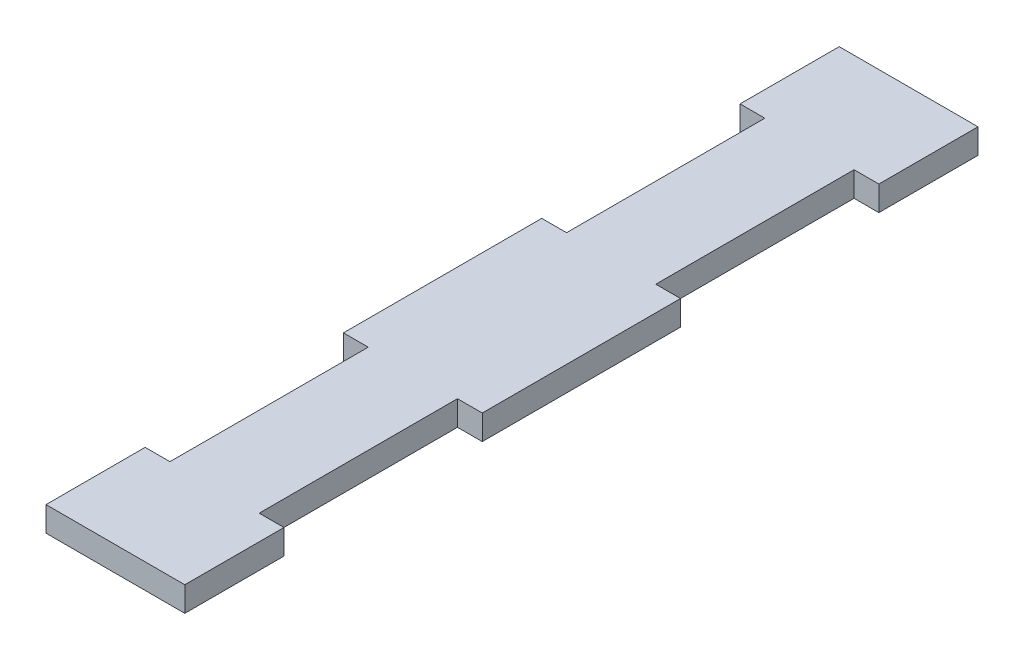
ISO-10303-21;
HEADER;
FILE_DESCRIPTION(('STEP AP214'),'2;1');
FILE_NAME('part.step','',(''),(''),'','','');
FILE_SCHEMA(('AUTOMOTIVE_DESIGN { 1 0 10303 214 1 1 1 1 }'));
ENDSEC;
DATA;
#1=APPLICATION_CONTEXT('core data for automotive mechanical design processes');
#2=APPLICATION_PROTOCOL_DEFINITION('international standard','automotive_design',2000,#1);
#3=PRODUCT_CONTEXT('',#1,'mechanical');
#4=PRODUCT('Part','Part','',(#3));
#5=PRODUCT_RELATED_PRODUCT_CATEGORY('part','',(#4));
#6=PRODUCT_DEFINITION_FORMATION('','',#4);
#7=PRODUCT_DEFINITION_CONTEXT('part definition',#1,'design');
#8=PRODUCT_DEFINITION('design','',#6,#7);
#9=PRODUCT_DEFINITION_SHAPE('','',#8);
#10=(LENGTH_UNIT() NAMED_UNIT(*) SI_UNIT(.MILLI.,.METRE.));
#11=(NAMED_UNIT(*) PLANE_ANGLE_UNIT() SI_UNIT($,.RADIAN.));
#12=(NAMED_UNIT(*) SI_UNIT($,.STERADIAN.) SOLID_ANGLE_UNIT());
#13=UNCERTAINTY_MEASURE_WITH_UNIT(LENGTH_MEASURE(1.E-05),#10,'distance_accuracy_value','');
#14=(GEOMETRIC_REPRESENTATION_CONTEXT(3) GLOBAL_UNCERTAINTY_ASSIGNED_CONTEXT((#13)) GLOBAL_UNIT_ASSIGNED_CONTEXT((#10,
#11,#12)) REPRESENTATION_CONTEXT('',''));
#15=CARTESIAN_POINT('',(0.,0.,0.));
#16=DIRECTION('',(0.,0.,1.));
#17=DIRECTION('',(1.,0.,0.));
#18=AXIS2_PLACEMENT_3D('',#15,#16,#17);
#19=CARTESIAN_POINT('',(0.,3.175,0.));
#20=DIRECTION('',(1.,0.,0.));
#21=DIRECTION('',(0.,0.,-1.));
#22=AXIS2_PLACEMENT_3D('',#19,#20,#21);
#23=PLANE('',#22);
#24=DIRECTION('',(0.,0.,1.));
#25=VECTOR('',#24,1.);
#26=CARTESIAN_POINT('',(0.,0.,0.));
#27=LINE('',#26,#25);
#28=CARTESIAN_POINT('',(0.,0.,-12.7));
#29=VERTEX_POINT('',#28);
#30=CARTESIAN_POINT('',(0.,0.,0.));
#31=VERTEX_POINT('',#30);
#32=EDGE_CURVE('E212',#29,#31,#27,.T.);
#33=ORIENTED_EDGE('',*,*,#32,.T.);
#34=DIRECTION('',(0.,-1.,0.));
#35=VECTOR('',#34,1.);
#36=CARTESIAN_POINT('',(0.,3.175,0.));
#37=LINE('',#36,#35);
#38=CARTESIAN_POINT('',(0.,3.175,0.));
#39=VERTEX_POINT('',#38);
#40=EDGE_CURVE('E11',#39,#31,#37,.T.);
#41=ORIENTED_EDGE('',*,*,#40,.F.);
#42=DIRECTION('',(0.,0.,1.));
#43=VECTOR('',#42,1.);
#44=CARTESIAN_POINT('',(0.,3.175,0.));
#45=LINE('',#44,#43);
#46=CARTESIAN_POINT('',(0.,3.175,-12.7));
#47=VERTEX_POINT('',#46);
#48=EDGE_CURVE('E270',#47,#39,#45,.T.);
#49=ORIENTED_EDGE('',*,*,#48,.F.);
#50=DIRECTION('',(0.,-1.,0.));
#51=VECTOR('',#50,1.);
#52=CARTESIAN_POINT('',(0.,3.175,-12.7));
#53=LINE('',#52,#51);
#54=EDGE_CURVE('E208',#47,#29,#53,.T.);
#55=ORIENTED_EDGE('',*,*,#54,.T.);
#56=EDGE_LOOP('',(#33,#41,#49,#55));
#57=FACE_BOUND('',#56,.T.);
#58=ADVANCED_FACE('F39',(#57),#23,.F.);
#59=CARTESIAN_POINT('',(0.,3.175,0.));
#60=DIRECTION('',(0.,0.,-1.));
#61=DIRECTION('',(-1.,0.,0.));
#62=AXIS2_PLACEMENT_3D('',#59,#60,#61);
#63=PLANE('',#62);
#64=DIRECTION('',(1.,0.,0.));
#65=VECTOR('',#64,1.);
#66=CARTESIAN_POINT('',(0.,0.,0.));
#67=LINE('',#66,#65);
#68=CARTESIAN_POINT('',(17.78,0.,0.));
#69=VERTEX_POINT('',#68);
#70=EDGE_CURVE('E216',#31,#69,#67,.T.);
#71=ORIENTED_EDGE('',*,*,#70,.T.);
#72=DIRECTION('',(0.,-1.,0.));
#73=VECTOR('',#72,1.);
#74=CARTESIAN_POINT('',(17.78,3.175,0.));
#75=LINE('',#74,#73);
#76=CARTESIAN_POINT('',(17.78,3.175,0.));
#77=VERTEX_POINT('',#76);
#78=EDGE_CURVE('E48',#77,#69,#75,.T.);
#79=ORIENTED_EDGE('',*,*,#78,.F.);
#80=DIRECTION('',(1.,0.,0.));
#81=VECTOR('',#80,1.);
#82=CARTESIAN_POINT('',(0.,3.175,0.));
#83=LINE('',#82,#81);
#84=EDGE_CURVE('E135',#39,#77,#83,.T.);
#85=ORIENTED_EDGE('',*,*,#84,.F.);
#86=ORIENTED_EDGE('',*,*,#40,.T.);
#87=EDGE_LOOP('',(#71,#79,#85,#86));
#88=FACE_BOUND('',#87,.T.);
#89=ADVANCED_FACE('F420',(#88),#63,.F.);
#90=CARTESIAN_POINT('',(17.78,3.175,0.));
#91=DIRECTION('',(-1.,0.,0.));
#92=DIRECTION('',(0.,0.,1.));
#93=AXIS2_PLACEMENT_3D('',#90,#91,#92);
#94=PLANE('',#93);
#95=DIRECTION('',(0.,0.,-1.));
#96=VECTOR('',#95,1.);
#97=CARTESIAN_POINT('',(17.78,0.,0.));
#98=LINE('',#97,#96);
#99=CARTESIAN_POINT('',(17.78,0.,-12.7));
#100=VERTEX_POINT('',#99);
#101=EDGE_CURVE('E219',#69,#100,#98,.T.);
#102=ORIENTED_EDGE('',*,*,#101,.T.);
#103=DIRECTION('',(0.,-1.,0.));
#104=VECTOR('',#103,1.);
#105=CARTESIAN_POINT('',(17.78,3.175,-12.7));
#106=LINE('',#105,#104);
#107=CARTESIAN_POINT('',(17.78,3.175,-12.7));
#108=VERTEX_POINT('',#107);
#109=EDGE_CURVE('E329',#108,#100,#106,.T.);
#110=ORIENTED_EDGE('',*,*,#109,.F.);
#111=DIRECTION('',(0.,0.,-1.));
#112=VECTOR('',#111,1.);
#113=CARTESIAN_POINT('',(17.78,3.175,0.));
#114=LINE('',#113,#112);
#115=EDGE_CURVE('E339',#77,#108,#114,.T.);
#116=ORIENTED_EDGE('',*,*,#115,.F.);
#117=ORIENTED_EDGE('',*,*,#78,.T.);
#118=EDGE_LOOP('',(#102,#110,#116,#117));
#119=FACE_BOUND('',#118,.T.);
#120=ADVANCED_FACE('F337',(#119),#94,.F.);
#121=CARTESIAN_POINT('',(17.78,3.175,-12.7));
#122=DIRECTION('',(0.,0.,1.));
#123=DIRECTION('',(1.,0.,0.));
#124=AXIS2_PLACEMENT_3D('',#121,#122,#123);
#125=PLANE('',#124);
#126=DIRECTION('',(-1.,0.,0.));
#127=VECTOR('',#126,1.);
#128=CARTESIAN_POINT('',(17.78,0.,-12.7));
#129=LINE('',#128,#127);
#130=CARTESIAN_POINT('',(14.605,0.,-12.7));
#131=VERTEX_POINT('',#130);
#132=EDGE_CURVE('E222',#100,#131,#129,.T.);
#133=ORIENTED_EDGE('',*,*,#132,.T.);
#134=DIRECTION('',(0.,-1.,0.));
#135=VECTOR('',#134,1.);
#136=CARTESIAN_POINT('',(14.605,3.175,-12.7));
#137=LINE('',#136,#135);
#138=CARTESIAN_POINT('',(14.605,3.175,-12.7));
#139=VERTEX_POINT('',#138);
#140=EDGE_CURVE('E325',#139,#131,#137,.T.);
#141=ORIENTED_EDGE('',*,*,#140,.F.);
#142=DIRECTION('',(-1.,0.,0.));
#143=VECTOR('',#142,1.);
#144=CARTESIAN_POINT('',(17.78,3.175,-12.7));
#145=LINE('',#144,#143);
#146=EDGE_CURVE('E358',#108,#139,#145,.T.);
#147=ORIENTED_EDGE('',*,*,#146,.F.);
#148=ORIENTED_EDGE('',*,*,#109,.T.);
#149=EDGE_LOOP('',(#133,#141,#147,#148));
#150=FACE_BOUND('',#149,.T.);
#151=ADVANCED_FACE('F348',(#150),#125,.F.);
#152=CARTESIAN_POINT('',(14.605,3.175,-38.1));
#153=DIRECTION('',(-1.,0.,0.));
#154=DIRECTION('',(0.,0.,1.));
#155=AXIS2_PLACEMENT_3D('',#152,#153,#154);
#156=PLANE('',#155);
#157=DIRECTION('',(0.,0.,-1.));
#158=VECTOR('',#157,1.);
#159=CARTESIAN_POINT('',(14.605,0.,-38.1));
#160=LINE('',#159,#158);
#161=CARTESIAN_POINT('',(14.605,0.,-38.1));
#162=VERTEX_POINT('',#161);
#163=EDGE_CURVE('E225',#131,#162,#160,.T.);
#164=ORIENTED_EDGE('',*,*,#163,.T.);
#165=DIRECTION('',(0.,-1.,0.));
#166=VECTOR('',#165,1.);
#167=CARTESIAN_POINT('',(14.605,3.175,-38.1));
#168=LINE('',#167,#166);
#169=CARTESIAN_POINT('',(14.605,3.175,-38.1));
#170=VERTEX_POINT('',#169);
#171=EDGE_CURVE('E321',#170,#162,#168,.T.);
#172=ORIENTED_EDGE('',*,*,#171,.F.);
#173=DIRECTION('',(0.,0.,-1.));
#174=VECTOR('',#173,1.);
#175=CARTESIAN_POINT('',(14.605,3.175,-38.1));
#176=LINE('',#175,#174);
#177=EDGE_CURVE('E354',#139,#170,#176,.T.);
#178=ORIENTED_EDGE('',*,*,#177,.F.);
#179=ORIENTED_EDGE('',*,*,#140,.T.);
#180=EDGE_LOOP('',(#164,#172,#178,#179));
#181=FACE_BOUND('',#180,.T.);
#182=ADVANCED_FACE('F352',(#181),#156,.F.);
#183=CARTESIAN_POINT('',(17.78,3.175,-38.1));
#184=DIRECTION('',(0.,0.,-1.));
#185=DIRECTION('',(-1.,0.,0.));
#186=AXIS2_PLACEMENT_3D('',#183,#184,#185);
#187=PLANE('',#186);
#188=DIRECTION('',(1.,0.,0.));
#189=VECTOR('',#188,1.);
#190=CARTESIAN_POINT('',(17.78,0.,-38.1));
#191=LINE('',#190,#189);
#192=CARTESIAN_POINT('',(17.78,0.,-38.1));
#193=VERTEX_POINT('',#192);
#194=EDGE_CURVE('E228',#162,#193,#191,.T.);
#195=ORIENTED_EDGE('',*,*,#194,.T.);
#196=DIRECTION('',(0.,-1.,0.));
#197=VECTOR('',#196,1.);
#198=CARTESIAN_POINT('',(17.78,3.175,-38.1));
#199=LINE('',#198,#197);
#200=CARTESIAN_POINT('',(17.78,3.175,-38.1));
#201=VERTEX_POINT('',#200);
#202=EDGE_CURVE('E317',#201,#193,#199,.T.);
#203=ORIENTED_EDGE('',*,*,#202,.F.);
#204=DIRECTION('',(1.,0.,0.));
#205=VECTOR('',#204,1.);
#206=CARTESIAN_POINT('',(17.78,3.175,-38.1));
#207=LINE('',#206,#205);
#208=EDGE_CURVE('E357',#170,#201,#207,.T.);
#209=ORIENTED_EDGE('',*,*,#208,.F.);
#210=ORIENTED_EDGE('',*,*,#171,.T.);
#211=EDGE_LOOP('',(#195,#203,#209,#210));
#212=FACE_BOUND('',#211,.T.);
#213=ADVANCED_FACE('F433',(#212),#187,.F.);
#214=CARTESIAN_POINT('',(17.78,3.175,-38.1));
#215=DIRECTION('',(-1.,0.,0.));
#216=DIRECTION('',(0.,0.,1.));
#217=AXIS2_PLACEMENT_3D('',#214,#215,#216);
#218=PLANE('',#217);
#219=DIRECTION('',(0.,0.,-1.));
#220=VECTOR('',#219,1.);
#221=CARTESIAN_POINT('',(17.78,0.,-38.1));
#222=LINE('',#221,#220);
#223=CARTESIAN_POINT('',(17.78,0.,-63.5));
#224=VERTEX_POINT('',#223);
#225=EDGE_CURVE('E231',#193,#224,#222,.T.);
#226=ORIENTED_EDGE('',*,*,#225,.T.);
#227=DIRECTION('',(0.,-1.,0.));
#228=VECTOR('',#227,1.);
#229=CARTESIAN_POINT('',(17.78,3.175,-63.5));
#230=LINE('',#229,#228);
#231=CARTESIAN_POINT('',(17.78,3.175,-63.5));
#232=VERTEX_POINT('',#231);
#233=EDGE_CURVE('E313',#232,#224,#230,.T.);
#234=ORIENTED_EDGE('',*,*,#233,.F.);
#235=DIRECTION('',(0.,0.,-1.));
#236=VECTOR('',#235,1.);
#237=CARTESIAN_POINT('',(17.78,3.175,-38.1));
#238=LINE('',#237,#236);
#239=EDGE_CURVE('E362',#201,#232,#238,.T.);
#240=ORIENTED_EDGE('',*,*,#239,.F.);
#241=ORIENTED_EDGE('',*,*,#202,.T.);
#242=EDGE_LOOP('',(#226,#234,#240,#241));
#243=FACE_BOUND('',#242,.T.);
#244=ADVANCED_FACE('F436',(#243),#218,.F.);
#245=CARTESIAN_POINT('',(17.78,3.175,-63.5));
#246=DIRECTION('',(0.,0.,1.));
#247=DIRECTION('',(1.,0.,0.));
#248=AXIS2_PLACEMENT_3D('',#245,#246,#247);
#249=PLANE('',#248);
#250=DIRECTION('',(-1.,0.,0.));
#251=VECTOR('',#250,1.);
#252=CARTESIAN_POINT('',(17.78,0.,-63.5));
#253=LINE('',#252,#251);
#254=CARTESIAN_POINT('',(14.605,0.,-63.5));
#255=VERTEX_POINT('',#254);
#256=EDGE_CURVE('E234',#224,#255,#253,.T.);
#257=ORIENTED_EDGE('',*,*,#256,.T.);
#258=DIRECTION('',(0.,-1.,0.));
#259=VECTOR('',#258,1.);
#260=CARTESIAN_POINT('',(14.605,3.175,-63.5));
#261=LINE('',#260,#259);
#262=CARTESIAN_POINT('',(14.605,3.175,-63.5));
#263=VERTEX_POINT('',#262);
#264=EDGE_CURVE('E309',#263,#255,#261,.T.);
#265=ORIENTED_EDGE('',*,*,#264,.F.);
#266=DIRECTION('',(-1.,0.,0.));
#267=VECTOR('',#266,1.);
#268=CARTESIAN_POINT('',(17.78,3.175,-63.5));
#269=LINE('',#268,#267);
#270=EDGE_CURVE('E369',#232,#263,#269,.T.);
#271=ORIENTED_EDGE('',*,*,#270,.F.);
#272=ORIENTED_EDGE('',*,*,#233,.T.);
#273=EDGE_LOOP('',(#257,#265,#271,#272));
#274=FACE_BOUND('',#273,.T.);
#275=ADVANCED_FACE('F440',(#274),#249,.F.);
#276=CARTESIAN_POINT('',(14.605,3.175,-88.9));
#277=DIRECTION('',(-1.,0.,0.));
#278=DIRECTION('',(0.,0.,1.));
#279=AXIS2_PLACEMENT_3D('',#276,#277,#278);
#280=PLANE('',#279);
#281=DIRECTION('',(0.,0.,-1.));
#282=VECTOR('',#281,1.);
#283=CARTESIAN_POINT('',(14.605,0.,-88.9));
#284=LINE('',#283,#282);
#285=CARTESIAN_POINT('',(14.605,0.,-88.9));
#286=VERTEX_POINT('',#285);
#287=EDGE_CURVE('E237',#255,#286,#284,.T.);
#288=ORIENTED_EDGE('',*,*,#287,.T.);
#289=DIRECTION('',(0.,-1.,0.));
#290=VECTOR('',#289,1.);
#291=CARTESIAN_POINT('',(14.605,3.175,-88.9));
#292=LINE('',#291,#290);
#293=CARTESIAN_POINT('',(14.605,3.175,-88.9));
#294=VERTEX_POINT('',#293);
#295=EDGE_CURVE('E305',#294,#286,#292,.T.);
#296=ORIENTED_EDGE('',*,*,#295,.F.);
#297=DIRECTION('',(0.,0.,-1.));
#298=VECTOR('',#297,1.);
#299=CARTESIAN_POINT('',(14.605,3.175,-88.9));
#300=LINE('',#299,#298);
#301=EDGE_CURVE('E372',#263,#294,#300,.T.);
#302=ORIENTED_EDGE('',*,*,#301,.F.);
#303=ORIENTED_EDGE('',*,*,#264,.T.);
#304=EDGE_LOOP('',(#288,#296,#302,#303));
#305=FACE_BOUND('',#304,.T.);
#306=ADVANCED_FACE('F444',(#305),#280,.F.);
#307=CARTESIAN_POINT('',(17.78,3.175,-88.9));
#308=DIRECTION('',(0.,0.,-1.));
#309=DIRECTION('',(-1.,0.,0.));
#310=AXIS2_PLACEMENT_3D('',#307,#308,#309);
#311=PLANE('',#310);
#312=DIRECTION('',(1.,0.,0.));
#313=VECTOR('',#312,1.);
#314=CARTESIAN_POINT('',(17.78,0.,-88.9));
#315=LINE('',#314,#313);
#316=CARTESIAN_POINT('',(17.78,0.,-88.9));
#317=VERTEX_POINT('',#316);
#318=EDGE_CURVE('E240',#286,#317,#315,.T.);
#319=ORIENTED_EDGE('',*,*,#318,.T.);
#320=DIRECTION('',(0.,-1.,0.));
#321=VECTOR('',#320,1.);
#322=CARTESIAN_POINT('',(17.78,3.175,-88.9));
#323=LINE('',#322,#321);
#324=CARTESIAN_POINT('',(17.78,3.175,-88.9));
#325=VERTEX_POINT('',#324);
#326=EDGE_CURVE('E301',#325,#317,#323,.T.);
#327=ORIENTED_EDGE('',*,*,#326,.F.);
#328=DIRECTION('',(1.,0.,0.));
#329=VECTOR('',#328,1.);
#330=CARTESIAN_POINT('',(17.78,3.175,-88.9));
#331=LINE('',#330,#329);
#332=EDGE_CURVE('E375',#294,#325,#331,.T.);
#333=ORIENTED_EDGE('',*,*,#332,.F.);
#334=ORIENTED_EDGE('',*,*,#295,.T.);
#335=EDGE_LOOP('',(#319,#327,#333,#334));
#336=FACE_BOUND('',#335,.T.);
#337=ADVANCED_FACE('F448',(#336),#311,.F.);
#338=CARTESIAN_POINT('',(17.78,3.175,-88.9));
#339=DIRECTION('',(-1.,0.,0.));
#340=DIRECTION('',(0.,0.,1.));
#341=AXIS2_PLACEMENT_3D('',#338,#339,#340);
#342=PLANE('',#341);
#343=DIRECTION('',(0.,0.,-1.));
#344=VECTOR('',#343,1.);
#345=CARTESIAN_POINT('',(17.78,0.,-88.9));
#346=LINE('',#345,#344);
#347=CARTESIAN_POINT('',(17.78,0.,-101.6));
#348=VERTEX_POINT('',#347);
#349=EDGE_CURVE('E243',#317,#348,#346,.T.);
#350=ORIENTED_EDGE('',*,*,#349,.T.);
#351=DIRECTION('',(0.,-1.,0.));
#352=VECTOR('',#351,1.);
#353=CARTESIAN_POINT('',(17.78,3.175,-101.6));
#354=LINE('',#353,#352);
#355=CARTESIAN_POINT('',(17.78,3.175,-101.6));
#356=VERTEX_POINT('',#355);
#357=EDGE_CURVE('E297',#356,#348,#354,.T.);
#358=ORIENTED_EDGE('',*,*,#357,.F.);
#359=DIRECTION('',(0.,0.,-1.));
#360=VECTOR('',#359,1.);
#361=CARTESIAN_POINT('',(17.78,3.175,-88.9));
#362=LINE('',#361,#360);
#363=EDGE_CURVE('E378',#325,#356,#362,.T.);
#364=ORIENTED_EDGE('',*,*,#363,.F.);
#365=ORIENTED_EDGE('',*,*,#326,.T.);
#366=EDGE_LOOP('',(#350,#358,#364,#365));
#367=FACE_BOUND('',#366,.T.);
#368=ADVANCED_FACE('F452',(#367),#342,.F.);
#369=CARTESIAN_POINT('',(0.,3.175,-101.6));
#370=DIRECTION('',(0.,0.,1.));
#371=DIRECTION('',(1.,0.,0.));
#372=AXIS2_PLACEMENT_3D('',#369,#370,#371);
#373=PLANE('',#372);
#374=DIRECTION('',(-1.,0.,0.));
#375=VECTOR('',#374,1.);
#376=CARTESIAN_POINT('',(0.,0.,-101.6));
#377=LINE('',#376,#375);
#378=CARTESIAN_POINT('',(0.,0.,-101.6));
#379=VERTEX_POINT('',#378);
#380=EDGE_CURVE('E246',#348,#379,#377,.T.);
#381=ORIENTED_EDGE('',*,*,#380,.T.);
#382=DIRECTION('',(0.,-1.,0.));
#383=VECTOR('',#382,1.);
#384=CARTESIAN_POINT('',(0.,3.175,-101.6));
#385=LINE('',#384,#383);
#386=CARTESIAN_POINT('',(0.,3.175,-101.6));
#387=VERTEX_POINT('',#386);
#388=EDGE_CURVE('E293',#387,#379,#385,.T.);
#389=ORIENTED_EDGE('',*,*,#388,.F.);
#390=DIRECTION('',(-1.,0.,0.));
#391=VECTOR('',#390,1.);
#392=CARTESIAN_POINT('',(0.,3.175,-101.6));
#393=LINE('',#392,#391);
#394=EDGE_CURVE('E381',#356,#387,#393,.T.);
#395=ORIENTED_EDGE('',*,*,#394,.F.);
#396=ORIENTED_EDGE('',*,*,#357,.T.);
#397=EDGE_LOOP('',(#381,#389,#395,#396));
#398=FACE_BOUND('',#397,.T.);
#399=ADVANCED_FACE('F456',(#398),#373,.F.);
#400=CARTESIAN_POINT('',(0.,3.175,-88.9));
#401=DIRECTION('',(1.,0.,0.));
#402=DIRECTION('',(0.,0.,-1.));
#403=AXIS2_PLACEMENT_3D('',#400,#401,#402);
#404=PLANE('',#403);
#405=DIRECTION('',(0.,0.,1.));
#406=VECTOR('',#405,1.);
#407=CARTESIAN_POINT('',(0.,0.,-88.9));
#408=LINE('',#407,#406);
#409=CARTESIAN_POINT('',(0.,0.,-88.9));
#410=VERTEX_POINT('',#409);
#411=EDGE_CURVE('E249',#379,#410,#408,.T.);
#412=ORIENTED_EDGE('',*,*,#411,.T.);
#413=DIRECTION('',(0.,-1.,0.));
#414=VECTOR('',#413,1.);
#415=CARTESIAN_POINT('',(0.,3.175,-88.9));
#416=LINE('',#415,#414);
#417=CARTESIAN_POINT('',(0.,3.175,-88.9));
#418=VERTEX_POINT('',#417);
#419=EDGE_CURVE('E289',#418,#410,#416,.T.);
#420=ORIENTED_EDGE('',*,*,#419,.F.);
#421=DIRECTION('',(0.,0.,1.));
#422=VECTOR('',#421,1.);
#423=CARTESIAN_POINT('',(0.,3.175,-88.9));
#424=LINE('',#423,#422);
#425=EDGE_CURVE('E384',#387,#418,#424,.T.);
#426=ORIENTED_EDGE('',*,*,#425,.F.);
#427=ORIENTED_EDGE('',*,*,#388,.T.);
#428=EDGE_LOOP('',(#412,#420,#426,#427));
#429=FACE_BOUND('',#428,.T.);
#430=ADVANCED_FACE('F460',(#429),#404,.F.);
#431=CARTESIAN_POINT('',(0.,3.175,-88.9));
#432=DIRECTION('',(0.,0.,-1.));
#433=DIRECTION('',(-1.,0.,0.));
#434=AXIS2_PLACEMENT_3D('',#431,#432,#433);
#435=PLANE('',#434);
#436=DIRECTION('',(1.,0.,0.));
#437=VECTOR('',#436,1.);
#438=CARTESIAN_POINT('',(0.,0.,-88.9));
#439=LINE('',#438,#437);
#440=CARTESIAN_POINT('',(3.175,0.,-88.9));
#441=VERTEX_POINT('',#440);
#442=EDGE_CURVE('E252',#410,#441,#439,.T.);
#443=ORIENTED_EDGE('',*,*,#442,.T.);
#444=DIRECTION('',(0.,-1.,0.));
#445=VECTOR('',#444,1.);
#446=CARTESIAN_POINT('',(3.175,3.175,-88.9));
#447=LINE('',#446,#445);
#448=CARTESIAN_POINT('',(3.175,3.175,-88.9));
#449=VERTEX_POINT('',#448);
#450=EDGE_CURVE('E285',#449,#441,#447,.T.);
#451=ORIENTED_EDGE('',*,*,#450,.F.);
#452=DIRECTION('',(1.,0.,0.));
#453=VECTOR('',#452,1.);
#454=CARTESIAN_POINT('',(0.,3.175,-88.9));
#455=LINE('',#454,#453);
#456=EDGE_CURVE('E387',#418,#449,#455,.T.);
#457=ORIENTED_EDGE('',*,*,#456,.F.);
#458=ORIENTED_EDGE('',*,*,#419,.T.);
#459=EDGE_LOOP('',(#443,#451,#457,#458));
#460=FACE_BOUND('',#459,.T.);
#461=ADVANCED_FACE('F464',(#460),#435,.F.);
#462=CARTESIAN_POINT('',(3.175,3.175,-88.9));
#463=DIRECTION('',(1.,0.,0.));
#464=DIRECTION('',(0.,0.,-1.));
#465=AXIS2_PLACEMENT_3D('',#462,#463,#464);
#466=PLANE('',#465);
#467=DIRECTION('',(0.,0.,1.));
#468=VECTOR('',#467,1.);
#469=CARTESIAN_POINT('',(3.175,0.,-88.9));
#470=LINE('',#469,#468);
#471=CARTESIAN_POINT('',(3.175,0.,-63.5));
#472=VERTEX_POINT('',#471);
#473=EDGE_CURVE('E255',#441,#472,#470,.T.);
#474=ORIENTED_EDGE('',*,*,#473,.T.);
#475=DIRECTION('',(0.,-1.,0.));
#476=VECTOR('',#475,1.);
#477=CARTESIAN_POINT('',(3.175,3.175,-63.5));
#478=LINE('',#477,#476);
#479=CARTESIAN_POINT('',(3.175,3.175,-63.5));
#480=VERTEX_POINT('',#479);
#481=EDGE_CURVE('E281',#480,#472,#478,.T.);
#482=ORIENTED_EDGE('',*,*,#481,.F.);
#483=DIRECTION('',(0.,0.,1.));
#484=VECTOR('',#483,1.);
#485=CARTESIAN_POINT('',(3.175,3.175,-88.9));
#486=LINE('',#485,#484);
#487=EDGE_CURVE('E390',#449,#480,#486,.T.);
#488=ORIENTED_EDGE('',*,*,#487,.F.);
#489=ORIENTED_EDGE('',*,*,#450,.T.);
#490=EDGE_LOOP('',(#474,#482,#488,#489));
#491=FACE_BOUND('',#490,.T.);
#492=ADVANCED_FACE('F468',(#491),#466,.F.);
#493=CARTESIAN_POINT('',(0.,3.175,-63.5));
#494=DIRECTION('',(0.,0.,1.));
#495=DIRECTION('',(1.,0.,0.));
#496=AXIS2_PLACEMENT_3D('',#493,#494,#495);
#497=PLANE('',#496);
#498=DIRECTION('',(-1.,0.,0.));
#499=VECTOR('',#498,1.);
#500=CARTESIAN_POINT('',(0.,0.,-63.5));
#501=LINE('',#500,#499);
#502=CARTESIAN_POINT('',(0.,0.,-63.5));
#503=VERTEX_POINT('',#502);
#504=EDGE_CURVE('E258',#472,#503,#501,.T.);
#505=ORIENTED_EDGE('',*,*,#504,.T.);
#506=DIRECTION('',(0.,-1.,0.));
#507=VECTOR('',#506,1.);
#508=CARTESIAN_POINT('',(0.,3.175,-63.5));
#509=LINE('',#508,#507);
#510=CARTESIAN_POINT('',(0.,3.175,-63.5));
#511=VERTEX_POINT('',#510);
#512=EDGE_CURVE('E277',#511,#503,#509,.T.);
#513=ORIENTED_EDGE('',*,*,#512,.F.);
#514=DIRECTION('',(-1.,0.,0.));
#515=VECTOR('',#514,1.);
#516=CARTESIAN_POINT('',(0.,3.175,-63.5));
#517=LINE('',#516,#515);
#518=EDGE_CURVE('E393',#480,#511,#517,.T.);
#519=ORIENTED_EDGE('',*,*,#518,.F.);
#520=ORIENTED_EDGE('',*,*,#481,.T.);
#521=EDGE_LOOP('',(#505,#513,#519,#520));
#522=FACE_BOUND('',#521,.T.);
#523=ADVANCED_FACE('F401',(#522),#497,.F.);
#524=CARTESIAN_POINT('',(0.,3.175,-38.1));
#525=DIRECTION('',(1.,0.,0.));
#526=DIRECTION('',(0.,0.,-1.));
#527=AXIS2_PLACEMENT_3D('',#524,#525,#526);
#528=PLANE('',#527);
#529=DIRECTION('',(0.,0.,1.));
#530=VECTOR('',#529,1.);
#531=CARTESIAN_POINT('',(0.,0.,-38.1));
#532=LINE('',#531,#530);
#533=CARTESIAN_POINT('',(0.,0.,-38.1));
#534=VERTEX_POINT('',#533);
#535=EDGE_CURVE('E261',#503,#534,#532,.T.);
#536=ORIENTED_EDGE('',*,*,#535,.T.);
#537=DIRECTION('',(0.,-1.,0.));
#538=VECTOR('',#537,1.);
#539=CARTESIAN_POINT('',(0.,3.175,-38.1));
#540=LINE('',#539,#538);
#541=CARTESIAN_POINT('',(0.,3.175,-38.1));
#542=VERTEX_POINT('',#541);
#543=EDGE_CURVE('E201',#542,#534,#540,.T.);
#544=ORIENTED_EDGE('',*,*,#543,.F.);
#545=DIRECTION('',(0.,0.,1.));
#546=VECTOR('',#545,1.);
#547=CARTESIAN_POINT('',(0.,3.175,-38.1));
#548=LINE('',#547,#546);
#549=EDGE_CURVE('E190',#511,#542,#548,.T.);
#550=ORIENTED_EDGE('',*,*,#549,.F.);
#551=ORIENTED_EDGE('',*,*,#512,.T.);
#552=EDGE_LOOP('',(#536,#544,#550,#551));
#553=FACE_BOUND('',#552,.T.);
#554=ADVANCED_FACE('F405',(#553),#528,.F.);
#555=CARTESIAN_POINT('',(0.,3.175,-38.1));
#556=DIRECTION('',(0.,0.,-1.));
#557=DIRECTION('',(-1.,0.,0.));
#558=AXIS2_PLACEMENT_3D('',#555,#556,#557);
#559=PLANE('',#558);
#560=DIRECTION('',(1.,0.,0.));
#561=VECTOR('',#560,1.);
#562=CARTESIAN_POINT('',(0.,0.,-38.1));
#563=LINE('',#562,#561);
#564=CARTESIAN_POINT('',(3.175,0.,-38.1));
#565=VERTEX_POINT('',#564);
#566=EDGE_CURVE('E199',#534,#565,#563,.T.);
#567=ORIENTED_EDGE('',*,*,#566,.T.);
#568=DIRECTION('',(0.,-1.,0.));
#569=VECTOR('',#568,1.);
#570=CARTESIAN_POINT('',(3.175,3.175,-38.1));
#571=LINE('',#570,#569);
#572=CARTESIAN_POINT('',(3.175,3.175,-38.1));
#573=VERTEX_POINT('',#572);
#574=EDGE_CURVE('E196',#573,#565,#571,.T.);
#575=ORIENTED_EDGE('',*,*,#574,.F.);
#576=DIRECTION('',(1.,0.,0.));
#577=VECTOR('',#576,1.);
#578=CARTESIAN_POINT('',(0.,3.175,-38.1));
#579=LINE('',#578,#577);
#580=EDGE_CURVE('E184',#542,#573,#579,.T.);
#581=ORIENTED_EDGE('',*,*,#580,.F.);
#582=ORIENTED_EDGE('',*,*,#543,.T.);
#583=EDGE_LOOP('',(#567,#575,#581,#582));
#584=FACE_BOUND('',#583,.T.);
#585=ADVANCED_FACE('F197',(#584),#559,.F.);
#586=CARTESIAN_POINT('',(3.175,3.175,-38.1));
#587=DIRECTION('',(1.,0.,0.));
#588=DIRECTION('',(0.,0.,-1.));
#589=AXIS2_PLACEMENT_3D('',#586,#587,#588);
#590=PLANE('',#589);
#591=DIRECTION('',(0.,0.,1.));
#592=VECTOR('',#591,1.);
#593=CARTESIAN_POINT('',(3.175,0.,-38.1));
#594=LINE('',#593,#592);
#595=CARTESIAN_POINT('',(3.175,0.,-12.7));
#596=VERTEX_POINT('',#595);
#597=EDGE_CURVE('E121',#565,#596,#594,.T.);
#598=ORIENTED_EDGE('',*,*,#597,.T.);
#599=DIRECTION('',(0.,-1.,0.));
#600=VECTOR('',#599,1.);
#601=CARTESIAN_POINT('',(3.175,3.175,-12.7));
#602=LINE('',#601,#600);
#603=CARTESIAN_POINT('',(3.175,3.175,-12.7));
#604=VERTEX_POINT('',#603);
#605=EDGE_CURVE('E202',#604,#596,#602,.T.);
#606=ORIENTED_EDGE('',*,*,#605,.F.);
#607=DIRECTION('',(0.,0.,1.));
#608=VECTOR('',#607,1.);
#609=CARTESIAN_POINT('',(3.175,3.175,-38.1));
#610=LINE('',#609,#608);
#611=EDGE_CURVE('E188',#573,#604,#610,.T.);
#612=ORIENTED_EDGE('',*,*,#611,.F.);
#613=ORIENTED_EDGE('',*,*,#574,.T.);
#614=EDGE_LOOP('',(#598,#606,#612,#613));
#615=FACE_BOUND('',#614,.T.);
#616=ADVANCED_FACE('F204',(#615),#590,.F.);
#617=CARTESIAN_POINT('',(0.,3.175,-12.7));
#618=DIRECTION('',(0.,0.,1.));
#619=DIRECTION('',(1.,0.,0.));
#620=AXIS2_PLACEMENT_3D('',#617,#618,#619);
#621=PLANE('',#620);
#622=DIRECTION('',(-1.,0.,0.));
#623=VECTOR('',#622,1.);
#624=CARTESIAN_POINT('',(0.,0.,-12.7));
#625=LINE('',#624,#623);
#626=EDGE_CURVE('E127',#596,#29,#625,.T.);
#627=ORIENTED_EDGE('',*,*,#626,.T.);
#628=ORIENTED_EDGE('',*,*,#54,.F.);
#629=DIRECTION('',(-1.,0.,0.));
#630=VECTOR('',#629,1.);
#631=CARTESIAN_POINT('',(0.,3.175,-12.7));
#632=LINE('',#631,#630);
#633=EDGE_CURVE('E56',#604,#47,#632,.T.);
#634=ORIENTED_EDGE('',*,*,#633,.F.);
#635=ORIENTED_EDGE('',*,*,#605,.T.);
#636=EDGE_LOOP('',(#627,#628,#634,#635));
#637=FACE_BOUND('',#636,.T.);
#638=ADVANCED_FACE('F409',(#637),#621,.F.);
#639=CARTESIAN_POINT('',(0.,3.175,0.));
#640=DIRECTION('',(0.,-1.,0.));
#641=DIRECTION('',(0.,0.,-1.));
#642=AXIS2_PLACEMENT_3D('',#639,#640,#641);
#643=PLANE('',#642);
#644=ORIENTED_EDGE('',*,*,#48,.T.);
#645=ORIENTED_EDGE('',*,*,#84,.T.);
#646=ORIENTED_EDGE('',*,*,#115,.T.);
#647=ORIENTED_EDGE('',*,*,#146,.T.);
#648=ORIENTED_EDGE('',*,*,#177,.T.);
#649=ORIENTED_EDGE('',*,*,#208,.T.);
#650=ORIENTED_EDGE('',*,*,#239,.T.);
#651=ORIENTED_EDGE('',*,*,#270,.T.);
#652=ORIENTED_EDGE('',*,*,#301,.T.);
#653=ORIENTED_EDGE('',*,*,#332,.T.);
#654=ORIENTED_EDGE('',*,*,#363,.T.);
#655=ORIENTED_EDGE('',*,*,#394,.T.);
#656=ORIENTED_EDGE('',*,*,#425,.T.);
#657=ORIENTED_EDGE('',*,*,#456,.T.);
#658=ORIENTED_EDGE('',*,*,#487,.T.);
#659=ORIENTED_EDGE('',*,*,#518,.T.);
#660=ORIENTED_EDGE('',*,*,#549,.T.);
#661=ORIENTED_EDGE('',*,*,#580,.T.);
#662=ORIENTED_EDGE('',*,*,#611,.T.);
#663=ORIENTED_EDGE('',*,*,#633,.T.);
#664=EDGE_LOOP('',(#644,#645,#646,#647,#648,#649,#650,#651,#652,#653,#654,#655,#656,#657,#658,
#659,#660,#661,#662,#663));
#665=FACE_BOUND('',#664,.T.);
#666=ADVANCED_FACE('F186',(#665),#643,.F.);
#667=CARTESIAN_POINT('',(0.,0.,0.));
#668=DIRECTION('',(0.,-1.,0.));
#669=DIRECTION('',(0.,0.,-1.));
#670=AXIS2_PLACEMENT_3D('',#667,#668,#669);
#671=PLANE('',#670);
#672=ORIENTED_EDGE('',*,*,#32,.F.);
#673=ORIENTED_EDGE('',*,*,#626,.F.);
#674=ORIENTED_EDGE('',*,*,#597,.F.);
#675=ORIENTED_EDGE('',*,*,#566,.F.);
#676=ORIENTED_EDGE('',*,*,#535,.F.);
#677=ORIENTED_EDGE('',*,*,#504,.F.);
#678=ORIENTED_EDGE('',*,*,#473,.F.);
#679=ORIENTED_EDGE('',*,*,#442,.F.);
#680=ORIENTED_EDGE('',*,*,#411,.F.);
#681=ORIENTED_EDGE('',*,*,#380,.F.);
#682=ORIENTED_EDGE('',*,*,#349,.F.);
#683=ORIENTED_EDGE('',*,*,#318,.F.);
#684=ORIENTED_EDGE('',*,*,#287,.F.);
#685=ORIENTED_EDGE('',*,*,#256,.F.);
#686=ORIENTED_EDGE('',*,*,#225,.F.);
#687=ORIENTED_EDGE('',*,*,#194,.F.);
#688=ORIENTED_EDGE('',*,*,#163,.F.);
#689=ORIENTED_EDGE('',*,*,#132,.F.);
#690=ORIENTED_EDGE('',*,*,#101,.F.);
#691=ORIENTED_EDGE('',*,*,#70,.F.);
#692=EDGE_LOOP('',(#672,#673,#674,#675,#676,#677,#678,#679,#680,#681,#682,#683,#684,#685,#686,
#687,#688,#689,#690,#691));
#693=FACE_BOUND('',#692,.T.);
#694=ADVANCED_FACE('F343',(#693),#671,.T.);
#695=CLOSED_SHELL('',(#58,#89,#120,#151,#182,#213,#244,#275,#306,#337,#368,#399,#430,#461,#492,
#523,#554,#585,#616,#638,#666,#694));
#696=MANIFOLD_SOLID_BREP('B2',#695);
#697=ADVANCED_BREP_SHAPE_REPRESENTATION('',(#18,#696),#14);
#698=SHAPE_DEFINITION_REPRESENTATION(#9,#697);
ENDSEC;
END-ISO-10303-21;
